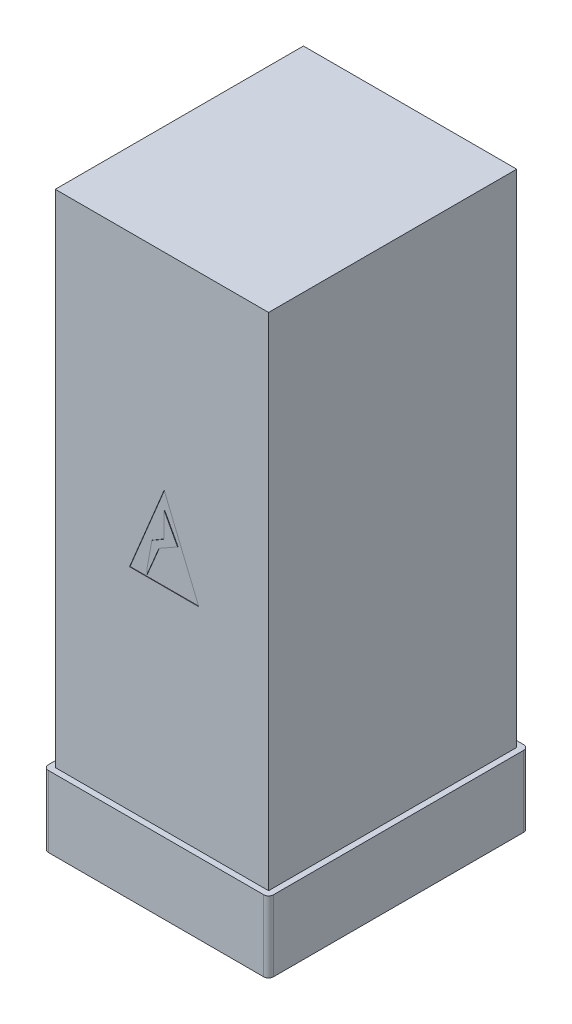
ISO-10303-21;
HEADER;
FILE_DESCRIPTION(('STEP AP214'),'2;1');
FILE_NAME('part.step','',(''),(''),'','','');
FILE_SCHEMA(('AUTOMOTIVE_DESIGN { 1 0 10303 214 1 1 1 1 }'));
ENDSEC;
DATA;
#1=APPLICATION_CONTEXT('core data for automotive mechanical design processes');
#2=APPLICATION_PROTOCOL_DEFINITION('international standard','automotive_design',2000,#1);
#3=PRODUCT_CONTEXT('',#1,'mechanical');
#4=PRODUCT('Part','Part','',(#3));
#5=PRODUCT_RELATED_PRODUCT_CATEGORY('part','',(#4));
#6=PRODUCT_DEFINITION_FORMATION('','',#4);
#7=PRODUCT_DEFINITION_CONTEXT('part definition',#1,'design');
#8=PRODUCT_DEFINITION('design','',#6,#7);
#9=PRODUCT_DEFINITION_SHAPE('','',#8);
#10=(LENGTH_UNIT() NAMED_UNIT(*) SI_UNIT(.MILLI.,.METRE.));
#11=(NAMED_UNIT(*) PLANE_ANGLE_UNIT() SI_UNIT($,.RADIAN.));
#12=(NAMED_UNIT(*) SI_UNIT($,.STERADIAN.) SOLID_ANGLE_UNIT());
#13=UNCERTAINTY_MEASURE_WITH_UNIT(LENGTH_MEASURE(1.E-05),#10,'distance_accuracy_value','');
#14=(GEOMETRIC_REPRESENTATION_CONTEXT(3) GLOBAL_UNCERTAINTY_ASSIGNED_CONTEXT((#13)) GLOBAL_UNIT_ASSIGNED_CONTEXT((#10,
#11,#12)) REPRESENTATION_CONTEXT('',''));
#15=CARTESIAN_POINT('',(0.,0.,0.));
#16=DIRECTION('',(0.,0.,1.));
#17=DIRECTION('',(1.,0.,0.));
#18=AXIS2_PLACEMENT_3D('',#15,#16,#17);
#19=CARTESIAN_POINT('',(-450.,2113.,523.5));
#20=DIRECTION('',(0.,0.,-1.));
#21=DIRECTION('',(-1.,0.,0.));
#22=AXIS2_PLACEMENT_3D('',#19,#20,#21);
#23=PLANE('',#22);
#24=DIRECTION('',(1.,0.,0.));
#25=VECTOR('',#24,1.);
#26=CARTESIAN_POINT('',(-136.509991438893,890.520139483411,523.5));
#27=LINE('',#26,#25);
#28=CARTESIAN_POINT('',(-136.509991438893,890.520139483411,523.5));
#29=VERTEX_POINT('',#28);
#30=CARTESIAN_POINT('',(155.469712472072,890.520139483411,523.5));
#31=VERTEX_POINT('',#30);
#32=EDGE_CURVE('E306',#29,#31,#27,.T.);
#33=ORIENTED_EDGE('',*,*,#32,.F.);
#34=DIRECTION('',(-0.382498039412264,-0.923956302995858,0.));
#35=VECTOR('',#34,1.);
#36=CARTESIAN_POINT('',(9.47986051658978,1243.17095070055,523.5));
#37=LINE('',#36,#35);
#38=CARTESIAN_POINT('',(9.47986051658978,1243.17095070055,523.5));
#39=VERTEX_POINT('',#38);
#40=EDGE_CURVE('E51',#39,#29,#37,.T.);
#41=ORIENTED_EDGE('',*,*,#40,.F.);
#42=DIRECTION('',(-0.382498039412264,0.923956302995858,0.));
#43=VECTOR('',#42,1.);
#44=CARTESIAN_POINT('',(155.469712472072,890.520139483411,523.5));
#45=LINE('',#44,#43);
#46=EDGE_CURVE('E298',#31,#39,#45,.T.);
#47=ORIENTED_EDGE('',*,*,#46,.F.);
#48=EDGE_LOOP('',(#33,#41,#47));
#49=FACE_BOUND('',#48,.T.);
#50=DIRECTION('',(1.,0.,0.));
#51=VECTOR('',#50,1.);
#52=CARTESIAN_POINT('',(-450.,0.,523.5));
#53=LINE('',#52,#51);
#54=CARTESIAN_POINT('',(-450.,0.,523.5));
#55=VERTEX_POINT('',#54);
#56=CARTESIAN_POINT('',(450.,0.,523.5));
#57=VERTEX_POINT('',#56);
#58=EDGE_CURVE('E349',#55,#57,#53,.T.);
#59=ORIENTED_EDGE('',*,*,#58,.T.);
#60=DIRECTION('',(0.,-1.,0.));
#61=VECTOR('',#60,1.);
#62=CARTESIAN_POINT('',(450.,2113.,523.5));
#63=LINE('',#62,#61);
#64=CARTESIAN_POINT('',(450.,2113.,523.5));
#65=VERTEX_POINT('',#64);
#66=EDGE_CURVE('E355',#65,#57,#63,.T.);
#67=ORIENTED_EDGE('',*,*,#66,.F.);
#68=DIRECTION('',(1.,0.,0.));
#69=VECTOR('',#68,1.);
#70=CARTESIAN_POINT('',(-450.,2113.,523.5));
#71=LINE('',#70,#69);
#72=CARTESIAN_POINT('',(-450.,2113.,523.5));
#73=VERTEX_POINT('',#72);
#74=EDGE_CURVE('E353',#73,#65,#71,.T.);
#75=ORIENTED_EDGE('',*,*,#74,.F.);
#76=DIRECTION('',(0.,-1.,0.));
#77=VECTOR('',#76,1.);
#78=CARTESIAN_POINT('',(-450.,2113.,523.5));
#79=LINE('',#78,#77);
#80=EDGE_CURVE('E368',#73,#55,#79,.T.);
#81=ORIENTED_EDGE('',*,*,#80,.T.);
#82=EDGE_LOOP('',(#59,#67,#75,#81));
#83=FACE_BOUND('',#82,.T.);
#84=ADVANCED_FACE('F35',(#49,#83),#23,.F.);
#85=CARTESIAN_POINT('',(450.,2113.,-523.5));
#86=DIRECTION('',(-1.,0.,0.));
#87=DIRECTION('',(0.,0.,1.));
#88=AXIS2_PLACEMENT_3D('',#85,#86,#87);
#89=PLANE('',#88);
#90=DIRECTION('',(0.,0.,-1.));
#91=VECTOR('',#90,1.);
#92=CARTESIAN_POINT('',(450.,0.,-523.5));
#93=LINE('',#92,#91);
#94=CARTESIAN_POINT('',(450.,0.,-523.5));
#95=VERTEX_POINT('',#94);
#96=EDGE_CURVE('E331',#57,#95,#93,.T.);
#97=ORIENTED_EDGE('',*,*,#96,.T.);
#98=DIRECTION('',(0.,-1.,0.));
#99=VECTOR('',#98,1.);
#100=CARTESIAN_POINT('',(450.,2113.,-523.5));
#101=LINE('',#100,#99);
#102=CARTESIAN_POINT('',(450.,2113.,-523.5));
#103=VERTEX_POINT('',#102);
#104=EDGE_CURVE('E11',#103,#95,#101,.T.);
#105=ORIENTED_EDGE('',*,*,#104,.F.);
#106=DIRECTION('',(0.,0.,-1.));
#107=VECTOR('',#106,1.);
#108=CARTESIAN_POINT('',(450.,2113.,-523.5));
#109=LINE('',#108,#107);
#110=EDGE_CURVE('E345',#65,#103,#109,.T.);
#111=ORIENTED_EDGE('',*,*,#110,.F.);
#112=ORIENTED_EDGE('',*,*,#66,.T.);
#113=EDGE_LOOP('',(#97,#105,#111,#112));
#114=FACE_BOUND('',#113,.T.);
#115=ADVANCED_FACE('F37',(#114),#89,.F.);
#116=CARTESIAN_POINT('',(-450.,2113.,-523.5));
#117=DIRECTION('',(0.,0.,1.));
#118=DIRECTION('',(1.,0.,0.));
#119=AXIS2_PLACEMENT_3D('',#116,#117,#118);
#120=PLANE('',#119);
#121=DIRECTION('',(-1.,0.,0.));
#122=VECTOR('',#121,1.);
#123=CARTESIAN_POINT('',(-450.,0.,-523.5));
#124=LINE('',#123,#122);
#125=CARTESIAN_POINT('',(-450.,0.,-523.5));
#126=VERTEX_POINT('',#125);
#127=EDGE_CURVE('E358',#95,#126,#124,.T.);
#128=ORIENTED_EDGE('',*,*,#127,.T.);
#129=DIRECTION('',(0.,-1.,0.));
#130=VECTOR('',#129,1.);
#131=CARTESIAN_POINT('',(-450.,2113.,-523.5));
#132=LINE('',#131,#130);
#133=CARTESIAN_POINT('',(-450.,2113.,-523.5));
#134=VERTEX_POINT('',#133);
#135=EDGE_CURVE('E44',#134,#126,#132,.T.);
#136=ORIENTED_EDGE('',*,*,#135,.F.);
#137=DIRECTION('',(-1.,0.,0.));
#138=VECTOR('',#137,1.);
#139=CARTESIAN_POINT('',(-450.,2113.,-523.5));
#140=LINE('',#139,#138);
#141=EDGE_CURVE('E348',#103,#134,#140,.T.);
#142=ORIENTED_EDGE('',*,*,#141,.F.);
#143=ORIENTED_EDGE('',*,*,#104,.T.);
#144=EDGE_LOOP('',(#128,#136,#142,#143));
#145=FACE_BOUND('',#144,.T.);
#146=ADVANCED_FACE('F377',(#145),#120,.F.);
#147=CARTESIAN_POINT('',(-450.,2113.,-523.5));
#148=DIRECTION('',(1.,0.,0.));
#149=DIRECTION('',(0.,0.,-1.));
#150=AXIS2_PLACEMENT_3D('',#147,#148,#149);
#151=PLANE('',#150);
#152=DIRECTION('',(0.,0.,1.));
#153=VECTOR('',#152,1.);
#154=CARTESIAN_POINT('',(-450.,0.,-523.5));
#155=LINE('',#154,#153);
#156=EDGE_CURVE('E361',#126,#55,#155,.T.);
#157=ORIENTED_EDGE('',*,*,#156,.T.);
#158=ORIENTED_EDGE('',*,*,#80,.F.);
#159=DIRECTION('',(0.,0.,1.));
#160=VECTOR('',#159,1.);
#161=CARTESIAN_POINT('',(-450.,2113.,-523.5));
#162=LINE('',#161,#160);
#163=EDGE_CURVE('E351',#134,#73,#162,.T.);
#164=ORIENTED_EDGE('',*,*,#163,.F.);
#165=ORIENTED_EDGE('',*,*,#135,.T.);
#166=EDGE_LOOP('',(#157,#158,#164,#165));
#167=FACE_BOUND('',#166,.T.);
#168=ADVANCED_FACE('F374',(#167),#151,.F.);
#169=CARTESIAN_POINT('',(0.,2113.,0.));
#170=DIRECTION('',(0.,1.,0.));
#171=DIRECTION('',(0.,0.,1.));
#172=AXIS2_PLACEMENT_3D('',#169,#170,#171);
#173=PLANE('',#172);
#174=ORIENTED_EDGE('',*,*,#110,.T.);
#175=ORIENTED_EDGE('',*,*,#141,.T.);
#176=ORIENTED_EDGE('',*,*,#163,.T.);
#177=ORIENTED_EDGE('',*,*,#74,.T.);
#178=EDGE_LOOP('',(#174,#175,#176,#177));
#179=FACE_BOUND('',#178,.T.);
#180=ADVANCED_FACE('F387',(#179),#173,.T.);
#181=CARTESIAN_POINT('',(9.47986051658978,1243.17095070055,521.5));
#182=DIRECTION('',(-0.923956302995858,0.382498039412264,0.));
#183=DIRECTION('',(-0.382498039412264,-0.923956302995858,0.));
#184=AXIS2_PLACEMENT_3D('',#181,#182,#183);
#185=PLANE('',#184);
#186=ORIENTED_EDGE('',*,*,#40,.T.);
#187=DIRECTION('',(0.,0.,1.));
#188=VECTOR('',#187,1.);
#189=CARTESIAN_POINT('',(-136.509991438893,890.520139483411,521.5));
#190=LINE('',#189,#188);
#191=CARTESIAN_POINT('',(-136.509991438893,890.520139483411,521.5));
#192=VERTEX_POINT('',#191);
#193=EDGE_CURVE('E304',#192,#29,#190,.T.);
#194=ORIENTED_EDGE('',*,*,#193,.F.);
#195=DIRECTION('',(-0.382498039412264,-0.923956302995858,0.));
#196=VECTOR('',#195,1.);
#197=CARTESIAN_POINT('',(9.47986051658978,1243.17095070055,521.5));
#198=LINE('',#197,#196);
#199=CARTESIAN_POINT('',(9.47986051658978,1243.17095070055,521.5));
#200=VERTEX_POINT('',#199);
#201=EDGE_CURVE('E294',#200,#192,#198,.T.);
#202=ORIENTED_EDGE('',*,*,#201,.F.);
#203=DIRECTION('',(0.,0.,1.));
#204=VECTOR('',#203,1.);
#205=CARTESIAN_POINT('',(9.47986051658978,1243.17095070055,521.5));
#206=LINE('',#205,#204);
#207=EDGE_CURVE('E311',#200,#39,#206,.T.);
#208=ORIENTED_EDGE('',*,*,#207,.T.);
#209=EDGE_LOOP('',(#186,#194,#202,#208));
#210=FACE_BOUND('',#209,.T.);
#211=ADVANCED_FACE('F389',(#210),#185,.F.);
#212=CARTESIAN_POINT('',(155.469712472072,890.520139483411,521.5));
#213=DIRECTION('',(0.923956302995858,0.382498039412264,0.));
#214=DIRECTION('',(-0.382498039412264,0.923956302995858,0.));
#215=AXIS2_PLACEMENT_3D('',#212,#213,#214);
#216=PLANE('',#215);
#217=ORIENTED_EDGE('',*,*,#46,.T.);
#218=ORIENTED_EDGE('',*,*,#207,.F.);
#219=DIRECTION('',(-0.382498039412264,0.923956302995858,0.));
#220=VECTOR('',#219,1.);
#221=CARTESIAN_POINT('',(155.469712472072,890.520139483411,521.5));
#222=LINE('',#221,#220);
#223=CARTESIAN_POINT('',(155.469712472072,890.520139483411,521.5));
#224=VERTEX_POINT('',#223);
#225=EDGE_CURVE('E301',#224,#200,#222,.T.);
#226=ORIENTED_EDGE('',*,*,#225,.F.);
#227=DIRECTION('',(0.,0.,1.));
#228=VECTOR('',#227,1.);
#229=CARTESIAN_POINT('',(155.469712472072,890.520139483411,521.5));
#230=LINE('',#229,#228);
#231=EDGE_CURVE('E314',#224,#31,#230,.T.);
#232=ORIENTED_EDGE('',*,*,#231,.T.);
#233=EDGE_LOOP('',(#217,#218,#226,#232));
#234=FACE_BOUND('',#233,.T.);
#235=ADVANCED_FACE('F395',(#234),#216,.F.);
#236=CARTESIAN_POINT('',(-136.509991438893,890.520139483411,521.5));
#237=DIRECTION('',(0.,-1.,0.));
#238=DIRECTION('',(0.,0.,-1.));
#239=AXIS2_PLACEMENT_3D('',#236,#237,#238);
#240=PLANE('',#239);
#241=ORIENTED_EDGE('',*,*,#32,.T.);
#242=ORIENTED_EDGE('',*,*,#231,.F.);
#243=DIRECTION('',(1.,0.,0.));
#244=VECTOR('',#243,1.);
#245=CARTESIAN_POINT('',(-136.509991438893,890.520139483411,521.5));
#246=LINE('',#245,#244);
#247=EDGE_CURVE('E297',#192,#224,#246,.T.);
#248=ORIENTED_EDGE('',*,*,#247,.F.);
#249=ORIENTED_EDGE('',*,*,#193,.T.);
#250=EDGE_LOOP('',(#241,#242,#248,#249));
#251=FACE_BOUND('',#250,.T.);
#252=ADVANCED_FACE('F463',(#251),#240,.F.);
#253=CARTESIAN_POINT('',(0.,0.,521.5));
#254=DIRECTION('',(0.,0.,1.));
#255=DIRECTION('',(1.,0.,0.));
#256=AXIS2_PLACEMENT_3D('',#253,#254,#255);
#257=PLANE('',#256);
#258=DIRECTION('',(-0.181458170868249,-0.983398663932969,0.));
#259=VECTOR('',#258,1.);
#260=CARTESIAN_POINT('',(-63.1768087324265,920.194596150194,521.5));
#261=LINE('',#260,#259);
#262=CARTESIAN_POINT('',(-42.1695458219167,1034.04184910241,521.5));
#263=VERTEX_POINT('',#262);
#264=CARTESIAN_POINT('',(-63.1768087324265,920.194596150194,521.5));
#265=VERTEX_POINT('',#264);
#266=EDGE_CURVE('E263',#263,#265,#261,.T.);
#267=ORIENTED_EDGE('',*,*,#266,.F.);
#268=DIRECTION('',(-0.863784349846672,-0.503861684353913,0.));
#269=VECTOR('',#268,1.);
#270=CARTESIAN_POINT('',(-42.1695458219167,1034.04184910241,521.5));
#271=LINE('',#270,#269);
#272=CARTESIAN_POINT('',(9.47986051658978,1064.16992085807,521.5));
#273=VERTEX_POINT('',#272);
#274=EDGE_CURVE('E260',#273,#263,#271,.T.);
#275=ORIENTED_EDGE('',*,*,#274,.F.);
#276=DIRECTION('',(0.,-1.,0.));
#277=VECTOR('',#276,1.);
#278=CARTESIAN_POINT('',(9.47986051658978,1064.16992085807,521.5));
#279=LINE('',#278,#277);
#280=CARTESIAN_POINT('',(9.47986051658978,1169.41196385255,521.5));
#281=VERTEX_POINT('',#280);
#282=EDGE_CURVE('E257',#281,#273,#279,.T.);
#283=ORIENTED_EDGE('',*,*,#282,.F.);
#284=DIRECTION('',(-0.472916146029514,0.881107438865767,0.));
#285=VECTOR('',#284,1.);
#286=CARTESIAN_POINT('',(9.47986051658978,1169.41196385255,521.5));
#287=LINE('',#286,#285);
#288=CARTESIAN_POINT('',(65.9663446589673,1064.16992085807,521.5));
#289=VERTEX_POINT('',#288);
#290=EDGE_CURVE('E254',#289,#281,#287,.T.);
#291=ORIENTED_EDGE('',*,*,#290,.F.);
#292=DIRECTION('',(0.869719659928419,0.493546059789758,0.));
#293=VECTOR('',#292,1.);
#294=CARTESIAN_POINT('',(65.9663446589673,1064.16992085807,521.5));
#295=LINE('',#294,#293);
#296=CARTESIAN_POINT('',(-12.5323017641928,1019.62373037163,521.5));
#297=VERTEX_POINT('',#296);
#298=EDGE_CURVE('E251',#297,#289,#295,.T.);
#299=ORIENTED_EDGE('',*,*,#298,.F.);
#300=DIRECTION('',(0.386882203116871,0.922129145462519,0.));
#301=VECTOR('',#300,1.);
#302=CARTESIAN_POINT('',(-12.5323017641928,1019.62373037163,521.5));
#303=LINE('',#302,#301);
#304=CARTESIAN_POINT('',(-63.1768087324265,898.91314829587,521.5));
#305=VERTEX_POINT('',#304);
#306=EDGE_CURVE('E247',#305,#297,#303,.T.);
#307=ORIENTED_EDGE('',*,*,#306,.F.);
#308=DIRECTION('',(0.,-1.,0.));
#309=VECTOR('',#308,1.);
#310=CARTESIAN_POINT('',(-63.1768087324265,898.91314829587,521.5));
#311=LINE('',#310,#309);
#312=EDGE_CURVE('E244',#265,#305,#311,.T.);
#313=ORIENTED_EDGE('',*,*,#312,.F.);
#314=EDGE_LOOP('',(#267,#275,#283,#291,#299,#307,#313));
#315=FACE_BOUND('',#314,.T.);
#316=ORIENTED_EDGE('',*,*,#201,.T.);
#317=ORIENTED_EDGE('',*,*,#247,.T.);
#318=ORIENTED_EDGE('',*,*,#225,.T.);
#319=EDGE_LOOP('',(#316,#317,#318));
#320=FACE_BOUND('',#319,.T.);
#321=ADVANCED_FACE('F430',(#315,#320),#257,.T.);
#322=CARTESIAN_POINT('',(-63.1768087324265,898.91314829587,521.5));
#323=DIRECTION('',(-1.,0.,0.));
#324=DIRECTION('',(0.,0.,1.));
#325=AXIS2_PLACEMENT_3D('',#322,#323,#324);
#326=PLANE('',#325);
#327=DIRECTION('',(0.,-1.,0.));
#328=VECTOR('',#327,1.);
#329=CARTESIAN_POINT('',(-63.1768087324265,898.91314829587,523.5));
#330=LINE('',#329,#328);
#331=CARTESIAN_POINT('',(-63.1768087324265,920.194596150194,523.5));
#332=VERTEX_POINT('',#331);
#333=CARTESIAN_POINT('',(-63.1768087324264,898.91314829587,523.5));
#334=VERTEX_POINT('',#333);
#335=EDGE_CURVE('E235',#332,#334,#330,.T.);
#336=ORIENTED_EDGE('',*,*,#335,.F.);
#337=DIRECTION('',(0.,0.,1.));
#338=VECTOR('',#337,1.);
#339=CARTESIAN_POINT('',(-63.1768087324265,920.194596150194,521.5));
#340=LINE('',#339,#338);
#341=EDGE_CURVE('E281',#265,#332,#340,.T.);
#342=ORIENTED_EDGE('',*,*,#341,.F.);
#343=ORIENTED_EDGE('',*,*,#312,.T.);
#344=DIRECTION('',(0.,0.,1.));
#345=VECTOR('',#344,1.);
#346=CARTESIAN_POINT('',(-63.1768087324265,898.91314829587,521.5));
#347=LINE('',#346,#345);
#348=EDGE_CURVE('E265',#305,#334,#347,.T.);
#349=ORIENTED_EDGE('',*,*,#348,.T.);
#350=EDGE_LOOP('',(#336,#342,#343,#349));
#351=FACE_BOUND('',#350,.T.);
#352=ADVANCED_FACE('F423',(#351),#326,.T.);
#353=CARTESIAN_POINT('',(-63.1768087324265,920.194596150194,521.5));
#354=DIRECTION('',(-0.983398663932969,0.181458170868249,0.));
#355=DIRECTION('',(-0.181458170868249,-0.983398663932969,0.));
#356=AXIS2_PLACEMENT_3D('',#353,#354,#355);
#357=PLANE('',#356);
#358=DIRECTION('',(-0.181458170868249,-0.983398663932969,0.));
#359=VECTOR('',#358,1.);
#360=CARTESIAN_POINT('',(-63.1768087324265,920.194596150194,523.5));
#361=LINE('',#360,#359);
#362=CARTESIAN_POINT('',(-42.1695458219167,1034.04184910241,523.5));
#363=VERTEX_POINT('',#362);
#364=EDGE_CURVE('E248',#363,#332,#361,.T.);
#365=ORIENTED_EDGE('',*,*,#364,.F.);
#366=DIRECTION('',(0.,0.,1.));
#367=VECTOR('',#366,1.);
#368=CARTESIAN_POINT('',(-42.1695458219167,1034.04184910241,521.5));
#369=LINE('',#368,#367);
#370=EDGE_CURVE('E283',#263,#363,#369,.T.);
#371=ORIENTED_EDGE('',*,*,#370,.F.);
#372=ORIENTED_EDGE('',*,*,#266,.T.);
#373=ORIENTED_EDGE('',*,*,#341,.T.);
#374=EDGE_LOOP('',(#365,#371,#372,#373));
#375=FACE_BOUND('',#374,.T.);
#376=ADVANCED_FACE('F443',(#375),#357,.T.);
#377=CARTESIAN_POINT('',(-42.1695458219167,1034.04184910241,521.5));
#378=DIRECTION('',(-0.503861684353913,0.863784349846672,0.));
#379=DIRECTION('',(-0.863784349846672,-0.503861684353913,0.));
#380=AXIS2_PLACEMENT_3D('',#377,#378,#379);
#381=PLANE('',#380);
#382=DIRECTION('',(-0.863784349846672,-0.503861684353913,0.));
#383=VECTOR('',#382,1.);
#384=CARTESIAN_POINT('',(-42.1695458219167,1034.04184910241,523.5));
#385=LINE('',#384,#383);
#386=CARTESIAN_POINT('',(9.47986051658978,1064.16992085807,523.5));
#387=VERTEX_POINT('',#386);
#388=EDGE_CURVE('E276',#387,#363,#385,.T.);
#389=ORIENTED_EDGE('',*,*,#388,.F.);
#390=DIRECTION('',(0.,0.,1.));
#391=VECTOR('',#390,1.);
#392=CARTESIAN_POINT('',(9.47986051658978,1064.16992085807,521.5));
#393=LINE('',#392,#391);
#394=EDGE_CURVE('E285',#273,#387,#393,.T.);
#395=ORIENTED_EDGE('',*,*,#394,.F.);
#396=ORIENTED_EDGE('',*,*,#274,.T.);
#397=ORIENTED_EDGE('',*,*,#370,.T.);
#398=EDGE_LOOP('',(#389,#395,#396,#397));
#399=FACE_BOUND('',#398,.T.);
#400=ADVANCED_FACE('F441',(#399),#381,.T.);
#401=CARTESIAN_POINT('',(9.47986051658978,1064.16992085807,521.5));
#402=DIRECTION('',(-1.,0.,0.));
#403=DIRECTION('',(0.,0.,1.));
#404=AXIS2_PLACEMENT_3D('',#401,#402,#403);
#405=PLANE('',#404);
#406=DIRECTION('',(0.,-1.,0.));
#407=VECTOR('',#406,1.);
#408=CARTESIAN_POINT('',(9.47986051658978,1064.16992085807,523.5));
#409=LINE('',#408,#407);
#410=CARTESIAN_POINT('',(9.47986051658978,1169.41196385255,523.5));
#411=VERTEX_POINT('',#410);
#412=EDGE_CURVE('E273',#411,#387,#409,.T.);
#413=ORIENTED_EDGE('',*,*,#412,.F.);
#414=DIRECTION('',(0.,0.,1.));
#415=VECTOR('',#414,1.);
#416=CARTESIAN_POINT('',(9.47986051658978,1169.41196385255,521.5));
#417=LINE('',#416,#415);
#418=EDGE_CURVE('E287',#281,#411,#417,.T.);
#419=ORIENTED_EDGE('',*,*,#418,.F.);
#420=ORIENTED_EDGE('',*,*,#282,.T.);
#421=ORIENTED_EDGE('',*,*,#394,.T.);
#422=EDGE_LOOP('',(#413,#419,#420,#421));
#423=FACE_BOUND('',#422,.T.);
#424=ADVANCED_FACE('F439',(#423),#405,.T.);
#425=CARTESIAN_POINT('',(9.47986051658978,1169.41196385255,521.5));
#426=DIRECTION('',(0.881107438865767,0.472916146029514,0.));
#427=DIRECTION('',(-0.472916146029514,0.881107438865767,0.));
#428=AXIS2_PLACEMENT_3D('',#425,#426,#427);
#429=PLANE('',#428);
#430=DIRECTION('',(-0.472916146029514,0.881107438865767,0.));
#431=VECTOR('',#430,1.);
#432=CARTESIAN_POINT('',(9.47986051658978,1169.41196385255,523.5));
#433=LINE('',#432,#431);
#434=CARTESIAN_POINT('',(65.9663446589673,1064.16992085807,523.5));
#435=VERTEX_POINT('',#434);
#436=EDGE_CURVE('E270',#435,#411,#433,.T.);
#437=ORIENTED_EDGE('',*,*,#436,.F.);
#438=DIRECTION('',(0.,0.,1.));
#439=VECTOR('',#438,1.);
#440=CARTESIAN_POINT('',(65.9663446589673,1064.16992085807,521.5));
#441=LINE('',#440,#439);
#442=EDGE_CURVE('E289',#289,#435,#441,.T.);
#443=ORIENTED_EDGE('',*,*,#442,.F.);
#444=ORIENTED_EDGE('',*,*,#290,.T.);
#445=ORIENTED_EDGE('',*,*,#418,.T.);
#446=EDGE_LOOP('',(#437,#443,#444,#445));
#447=FACE_BOUND('',#446,.T.);
#448=ADVANCED_FACE('F435',(#447),#429,.T.);
#449=CARTESIAN_POINT('',(65.9663446589673,1064.16992085807,521.5));
#450=DIRECTION('',(0.493546059789758,-0.869719659928419,0.));
#451=DIRECTION('',(0.869719659928419,0.493546059789758,0.));
#452=AXIS2_PLACEMENT_3D('',#449,#450,#451);
#453=PLANE('',#452);
#454=DIRECTION('',(0.869719659928419,0.493546059789758,0.));
#455=VECTOR('',#454,1.);
#456=CARTESIAN_POINT('',(65.9663446589673,1064.16992085807,523.5));
#457=LINE('',#456,#455);
#458=CARTESIAN_POINT('',(-12.532301764193,1019.62373037163,523.5));
#459=VERTEX_POINT('',#458);
#460=EDGE_CURVE('E59',#459,#435,#457,.T.);
#461=ORIENTED_EDGE('',*,*,#460,.F.);
#462=DIRECTION('',(0.,0.,1.));
#463=VECTOR('',#462,1.);
#464=CARTESIAN_POINT('',(-12.5323017641928,1019.62373037163,521.5));
#465=LINE('',#464,#463);
#466=EDGE_CURVE('E291',#297,#459,#465,.T.);
#467=ORIENTED_EDGE('',*,*,#466,.F.);
#468=ORIENTED_EDGE('',*,*,#298,.T.);
#469=ORIENTED_EDGE('',*,*,#442,.T.);
#470=EDGE_LOOP('',(#461,#467,#468,#469));
#471=FACE_BOUND('',#470,.T.);
#472=ADVANCED_FACE('F416',(#471),#453,.T.);
#473=CARTESIAN_POINT('',(-12.5323017641928,1019.62373037163,521.5));
#474=DIRECTION('',(0.922129145462519,-0.386882203116871,0.));
#475=DIRECTION('',(0.386882203116871,0.92212914546252,0.));
#476=AXIS2_PLACEMENT_3D('',#473,#474,#475);
#477=PLANE('',#476);
#478=DIRECTION('',(0.386882203116871,0.922129145462519,0.));
#479=VECTOR('',#478,1.);
#480=CARTESIAN_POINT('',(-12.5323017641928,1019.62373037163,523.5));
#481=LINE('',#480,#479);
#482=EDGE_CURVE('E238',#334,#459,#481,.T.);
#483=ORIENTED_EDGE('',*,*,#482,.F.);
#484=ORIENTED_EDGE('',*,*,#348,.F.);
#485=ORIENTED_EDGE('',*,*,#306,.T.);
#486=ORIENTED_EDGE('',*,*,#466,.T.);
#487=EDGE_LOOP('',(#483,#484,#485,#486));
#488=FACE_BOUND('',#487,.T.);
#489=ADVANCED_FACE('F408',(#488),#477,.T.);
#490=ORIENTED_EDGE('',*,*,#335,.T.);
#491=ORIENTED_EDGE('',*,*,#482,.T.);
#492=ORIENTED_EDGE('',*,*,#460,.T.);
#493=ORIENTED_EDGE('',*,*,#436,.T.);
#494=ORIENTED_EDGE('',*,*,#412,.T.);
#495=ORIENTED_EDGE('',*,*,#388,.T.);
#496=ORIENTED_EDGE('',*,*,#364,.T.);
#497=EDGE_LOOP('',(#490,#491,#492,#493,#494,#495,#496));
#498=FACE_BOUND('',#497,.T.);
#499=ADVANCED_FACE('F402',(#498),#23,.F.);
#500=CARTESIAN_POINT('',(454.356451520061,0.,527.856451520061));
#501=DIRECTION('',(0.,1.,0.));
#502=DIRECTION('',(0.,0.,1.));
#503=AXIS2_PLACEMENT_3D('',#500,#501,#502);
#504=PLANE('',#503);
#505=CARTESIAN_POINT('',(454.356451520061,0.,527.856451520061));
#506=DIRECTION('',(0.,-1.,0.));
#507=DIRECTION('',(0.,0.,1.));
#508=AXIS2_PLACEMENT_3D('',#505,#506,#507);
#509=CIRCLE('',#508,20.643548479939);
#510=CARTESIAN_POINT('',(475.,0.,527.856451520061));
#511=VERTEX_POINT('',#510);
#512=CARTESIAN_POINT('',(454.356451520061,0.,548.5));
#513=VERTEX_POINT('',#512);
#514=EDGE_CURVE('E234',#511,#513,#509,.T.);
#515=ORIENTED_EDGE('',*,*,#514,.F.);
#516=DIRECTION('',(0.,0.,1.));
#517=VECTOR('',#516,1.);
#518=CARTESIAN_POINT('',(475.,0.,527.856451520061));
#519=LINE('',#518,#517);
#520=CARTESIAN_POINT('',(475.,0.,-527.856451520061));
#521=VERTEX_POINT('',#520);
#522=EDGE_CURVE('E230',#521,#511,#519,.T.);
#523=ORIENTED_EDGE('',*,*,#522,.F.);
#524=CARTESIAN_POINT('',(454.356451520061,0.,-527.856451520061));
#525=DIRECTION('',(0.,-1.,0.));
#526=DIRECTION('',(0.,0.,-1.));
#527=AXIS2_PLACEMENT_3D('',#524,#525,#526);
#528=CIRCLE('',#527,20.643548479939);
#529=CARTESIAN_POINT('',(454.356451520061,0.,-548.5));
#530=VERTEX_POINT('',#529);
#531=EDGE_CURVE('E761',#530,#521,#528,.T.);
#532=ORIENTED_EDGE('',*,*,#531,.F.);
#533=DIRECTION('',(1.,0.,0.));
#534=VECTOR('',#533,1.);
#535=CARTESIAN_POINT('',(-454.356451520061,0.,-548.5));
#536=LINE('',#535,#534);
#537=CARTESIAN_POINT('',(-454.356451520061,0.,-548.5));
#538=VERTEX_POINT('',#537);
#539=EDGE_CURVE('E777',#538,#530,#536,.T.);
#540=ORIENTED_EDGE('',*,*,#539,.F.);
#541=CARTESIAN_POINT('',(-454.356451520061,0.,-527.856451520061));
#542=DIRECTION('',(0.,-1.,0.));
#543=DIRECTION('',(0.,0.,-1.));
#544=AXIS2_PLACEMENT_3D('',#541,#542,#543);
#545=CIRCLE('',#544,20.643548479939);
#546=CARTESIAN_POINT('',(-475.,0.,-527.856451520061));
#547=VERTEX_POINT('',#546);
#548=EDGE_CURVE('E775',#547,#538,#545,.T.);
#549=ORIENTED_EDGE('',*,*,#548,.F.);
#550=DIRECTION('',(0.,0.,-1.));
#551=VECTOR('',#550,1.);
#552=CARTESIAN_POINT('',(-475.,0.,527.856451520061));
#553=LINE('',#552,#551);
#554=CARTESIAN_POINT('',(-475.,0.,527.856451520061));
#555=VERTEX_POINT('',#554);
#556=EDGE_CURVE('E773',#555,#547,#553,.T.);
#557=ORIENTED_EDGE('',*,*,#556,.F.);
#558=CARTESIAN_POINT('',(-454.356451520061,0.,527.856451520061));
#559=DIRECTION('',(0.,-1.,0.));
#560=DIRECTION('',(0.,0.,-1.));
#561=AXIS2_PLACEMENT_3D('',#558,#559,#560);
#562=CIRCLE('',#561,20.643548479939);
#563=CARTESIAN_POINT('',(-454.356451520061,0.,548.5));
#564=VERTEX_POINT('',#563);
#565=EDGE_CURVE('E767',#564,#555,#562,.T.);
#566=ORIENTED_EDGE('',*,*,#565,.F.);
#567=DIRECTION('',(-1.,0.,0.));
#568=VECTOR('',#567,1.);
#569=CARTESIAN_POINT('',(-454.356451520061,0.,548.5));
#570=LINE('',#569,#568);
#571=EDGE_CURVE('E765',#513,#564,#570,.T.);
#572=ORIENTED_EDGE('',*,*,#571,.F.);
#573=EDGE_LOOP('',(#515,#523,#532,#540,#549,#557,#566,#572));
#574=FACE_BOUND('',#573,.T.);
#575=ORIENTED_EDGE('',*,*,#58,.F.);
#576=ORIENTED_EDGE('',*,*,#156,.F.);
#577=ORIENTED_EDGE('',*,*,#127,.F.);
#578=ORIENTED_EDGE('',*,*,#96,.F.);
#579=EDGE_LOOP('',(#575,#576,#577,#578));
#580=FACE_BOUND('',#579,.T.);
#581=ADVANCED_FACE('F380',(#574,#580),#504,.T.);
#582=CARTESIAN_POINT('',(454.356451520061,-300.,527.856451520061));
#583=DIRECTION('',(0.,1.,0.));
#584=DIRECTION('',(0.,0.,1.));
#585=AXIS2_PLACEMENT_3D('',#582,#583,#584);
#586=CYLINDRICAL_SURFACE('',#585,20.643548479939);
#587=ORIENTED_EDGE('',*,*,#514,.T.);
#588=DIRECTION('',(0.,1.,0.));
#589=VECTOR('',#588,1.);
#590=CARTESIAN_POINT('',(454.356451520061,-300.,548.5));
#591=LINE('',#590,#589);
#592=CARTESIAN_POINT('',(454.356451520061,-300.,548.5));
#593=VERTEX_POINT('',#592);
#594=EDGE_CURVE('E214',#593,#513,#591,.T.);
#595=ORIENTED_EDGE('',*,*,#594,.F.);
#596=CARTESIAN_POINT('',(454.356451520061,-300.,527.856451520061));
#597=DIRECTION('',(0.,-1.,0.));
#598=DIRECTION('',(0.,0.,1.));
#599=AXIS2_PLACEMENT_3D('',#596,#597,#598);
#600=CIRCLE('',#599,20.643548479939);
#601=CARTESIAN_POINT('',(475.,-300.,527.856451520061));
#602=VERTEX_POINT('',#601);
#603=EDGE_CURVE('E221',#602,#593,#600,.T.);
#604=ORIENTED_EDGE('',*,*,#603,.F.);
#605=DIRECTION('',(0.,1.,0.));
#606=VECTOR('',#605,1.);
#607=CARTESIAN_POINT('',(475.,-300.,527.856451520061));
#608=LINE('',#607,#606);
#609=EDGE_CURVE('E757',#602,#511,#608,.T.);
#610=ORIENTED_EDGE('',*,*,#609,.T.);
#611=EDGE_LOOP('',(#587,#595,#604,#610));
#612=FACE_BOUND('',#611,.T.);
#613=ADVANCED_FACE('F232',(#612),#586,.T.);
#614=CARTESIAN_POINT('',(-454.356451520061,-300.,548.5));
#615=DIRECTION('',(0.,0.,-1.));
#616=DIRECTION('',(-1.,0.,0.));
#617=AXIS2_PLACEMENT_3D('',#614,#615,#616);
#618=PLANE('',#617);
#619=ORIENTED_EDGE('',*,*,#571,.T.);
#620=DIRECTION('',(0.,1.,0.));
#621=VECTOR('',#620,1.);
#622=CARTESIAN_POINT('',(-454.356451520061,-300.,548.5));
#623=LINE('',#622,#621);
#624=CARTESIAN_POINT('',(-454.356451520061,-300.,548.5));
#625=VERTEX_POINT('',#624);
#626=EDGE_CURVE('E217',#625,#564,#623,.T.);
#627=ORIENTED_EDGE('',*,*,#626,.F.);
#628=DIRECTION('',(-1.,0.,0.));
#629=VECTOR('',#628,1.);
#630=CARTESIAN_POINT('',(-454.356451520061,-300.,548.5));
#631=LINE('',#630,#629);
#632=EDGE_CURVE('E210',#593,#625,#631,.T.);
#633=ORIENTED_EDGE('',*,*,#632,.F.);
#634=ORIENTED_EDGE('',*,*,#594,.T.);
#635=EDGE_LOOP('',(#619,#627,#633,#634));
#636=FACE_BOUND('',#635,.T.);
#637=ADVANCED_FACE('F212',(#636),#618,.F.);
#638=CARTESIAN_POINT('',(-454.356451520061,-300.,527.856451520061));
#639=DIRECTION('',(0.,1.,0.));
#640=DIRECTION('',(0.,0.,1.));
#641=AXIS2_PLACEMENT_3D('',#638,#639,#640);
#642=CYLINDRICAL_SURFACE('',#641,20.643548479939);
#643=ORIENTED_EDGE('',*,*,#565,.T.);
#644=DIRECTION('',(0.,1.,0.));
#645=VECTOR('',#644,1.);
#646=CARTESIAN_POINT('',(-475.,-300.,527.856451520061));
#647=LINE('',#646,#645);
#648=CARTESIAN_POINT('',(-475.,-300.,527.856451520061));
#649=VERTEX_POINT('',#648);
#650=EDGE_CURVE('E240',#649,#555,#647,.T.);
#651=ORIENTED_EDGE('',*,*,#650,.F.);
#652=CARTESIAN_POINT('',(-454.356451520061,-300.,527.856451520061));
#653=DIRECTION('',(0.,-1.,0.));
#654=DIRECTION('',(0.,0.,-1.));
#655=AXIS2_PLACEMENT_3D('',#652,#653,#654);
#656=CIRCLE('',#655,20.643548479939);
#657=EDGE_CURVE('E220',#625,#649,#656,.T.);
#658=ORIENTED_EDGE('',*,*,#657,.F.);
#659=ORIENTED_EDGE('',*,*,#626,.T.);
#660=EDGE_LOOP('',(#643,#651,#658,#659));
#661=FACE_BOUND('',#660,.T.);
#662=ADVANCED_FACE('F645',(#661),#642,.T.);
#663=CARTESIAN_POINT('',(-475.,-300.,527.856451520061));
#664=DIRECTION('',(1.,0.,0.));
#665=DIRECTION('',(0.,0.,-1.));
#666=AXIS2_PLACEMENT_3D('',#663,#664,#665);
#667=PLANE('',#666);
#668=ORIENTED_EDGE('',*,*,#556,.T.);
#669=DIRECTION('',(0.,1.,0.));
#670=VECTOR('',#669,1.);
#671=CARTESIAN_POINT('',(-475.,-300.,-527.856451520061));
#672=LINE('',#671,#670);
#673=CARTESIAN_POINT('',(-475.,-300.,-527.856451520061));
#674=VERTEX_POINT('',#673);
#675=EDGE_CURVE('E787',#674,#547,#672,.T.);
#676=ORIENTED_EDGE('',*,*,#675,.F.);
#677=DIRECTION('',(0.,0.,-1.));
#678=VECTOR('',#677,1.);
#679=CARTESIAN_POINT('',(-475.,-300.,527.856451520061));
#680=LINE('',#679,#678);
#681=EDGE_CURVE('E794',#649,#674,#680,.T.);
#682=ORIENTED_EDGE('',*,*,#681,.F.);
#683=ORIENTED_EDGE('',*,*,#650,.T.);
#684=EDGE_LOOP('',(#668,#676,#682,#683));
#685=FACE_BOUND('',#684,.T.);
#686=ADVANCED_FACE('F654',(#685),#667,.F.);
#687=CARTESIAN_POINT('',(-454.356451520061,-300.,-527.856451520061));
#688=DIRECTION('',(0.,1.,0.));
#689=DIRECTION('',(0.,0.,1.));
#690=AXIS2_PLACEMENT_3D('',#687,#688,#689);
#691=CYLINDRICAL_SURFACE('',#690,20.643548479939);
#692=ORIENTED_EDGE('',*,*,#548,.T.);
#693=DIRECTION('',(0.,1.,0.));
#694=VECTOR('',#693,1.);
#695=CARTESIAN_POINT('',(-454.356451520061,-300.,-548.5));
#696=LINE('',#695,#694);
#697=CARTESIAN_POINT('',(-454.356451520061,-300.,-548.5));
#698=VERTEX_POINT('',#697);
#699=EDGE_CURVE('E784',#698,#538,#696,.T.);
#700=ORIENTED_EDGE('',*,*,#699,.F.);
#701=CARTESIAN_POINT('',(-454.356451520061,-300.,-527.856451520061));
#702=DIRECTION('',(0.,-1.,0.));
#703=DIRECTION('',(0.,0.,-1.));
#704=AXIS2_PLACEMENT_3D('',#701,#702,#703);
#705=CIRCLE('',#704,20.643548479939);
#706=EDGE_CURVE('E804',#674,#698,#705,.T.);
#707=ORIENTED_EDGE('',*,*,#706,.F.);
#708=ORIENTED_EDGE('',*,*,#675,.T.);
#709=EDGE_LOOP('',(#692,#700,#707,#708));
#710=FACE_BOUND('',#709,.T.);
#711=ADVANCED_FACE('F664',(#710),#691,.T.);
#712=CARTESIAN_POINT('',(-454.356451520061,-300.,-548.5));
#713=DIRECTION('',(0.,0.,1.));
#714=DIRECTION('',(1.,0.,0.));
#715=AXIS2_PLACEMENT_3D('',#712,#713,#714);
#716=PLANE('',#715);
#717=ORIENTED_EDGE('',*,*,#539,.T.);
#718=DIRECTION('',(0.,1.,0.));
#719=VECTOR('',#718,1.);
#720=CARTESIAN_POINT('',(454.356451520061,-300.,-548.5));
#721=LINE('',#720,#719);
#722=CARTESIAN_POINT('',(454.356451520061,-300.,-548.5));
#723=VERTEX_POINT('',#722);
#724=EDGE_CURVE('E781',#723,#530,#721,.T.);
#725=ORIENTED_EDGE('',*,*,#724,.F.);
#726=DIRECTION('',(1.,0.,0.));
#727=VECTOR('',#726,1.);
#728=CARTESIAN_POINT('',(-454.356451520061,-300.,-548.5));
#729=LINE('',#728,#727);
#730=EDGE_CURVE('E801',#698,#723,#729,.T.);
#731=ORIENTED_EDGE('',*,*,#730,.F.);
#732=ORIENTED_EDGE('',*,*,#699,.T.);
#733=EDGE_LOOP('',(#717,#725,#731,#732));
#734=FACE_BOUND('',#733,.T.);
#735=ADVANCED_FACE('F675',(#734),#716,.F.);
#736=CARTESIAN_POINT('',(454.356451520061,-300.,-527.856451520061));
#737=DIRECTION('',(0.,1.,0.));
#738=DIRECTION('',(0.,0.,1.));
#739=AXIS2_PLACEMENT_3D('',#736,#737,#738);
#740=CYLINDRICAL_SURFACE('',#739,20.643548479939);
#741=ORIENTED_EDGE('',*,*,#531,.T.);
#742=DIRECTION('',(0.,1.,0.));
#743=VECTOR('',#742,1.);
#744=CARTESIAN_POINT('',(475.,-300.,-527.856451520061));
#745=LINE('',#744,#743);
#746=CARTESIAN_POINT('',(475.,-300.,-527.856451520061));
#747=VERTEX_POINT('',#746);
#748=EDGE_CURVE('E759',#747,#521,#745,.T.);
#749=ORIENTED_EDGE('',*,*,#748,.F.);
#750=CARTESIAN_POINT('',(454.356451520061,-300.,-527.856451520061));
#751=DIRECTION('',(0.,-1.,0.));
#752=DIRECTION('',(0.,0.,-1.));
#753=AXIS2_PLACEMENT_3D('',#750,#751,#752);
#754=CIRCLE('',#753,20.643548479939);
#755=EDGE_CURVE('E803',#723,#747,#754,.T.);
#756=ORIENTED_EDGE('',*,*,#755,.F.);
#757=ORIENTED_EDGE('',*,*,#724,.T.);
#758=EDGE_LOOP('',(#741,#749,#756,#757));
#759=FACE_BOUND('',#758,.T.);
#760=ADVANCED_FACE('F685',(#759),#740,.T.);
#761=CARTESIAN_POINT('',(475.,-300.,527.856451520061));
#762=DIRECTION('',(-1.,0.,0.));
#763=DIRECTION('',(0.,0.,1.));
#764=AXIS2_PLACEMENT_3D('',#761,#762,#763);
#765=PLANE('',#764);
#766=ORIENTED_EDGE('',*,*,#522,.T.);
#767=ORIENTED_EDGE('',*,*,#609,.F.);
#768=DIRECTION('',(0.,0.,1.));
#769=VECTOR('',#768,1.);
#770=CARTESIAN_POINT('',(475.,-300.,527.856451520061));
#771=LINE('',#770,#769);
#772=EDGE_CURVE('E226',#747,#602,#771,.T.);
#773=ORIENTED_EDGE('',*,*,#772,.F.);
#774=ORIENTED_EDGE('',*,*,#748,.T.);
#775=EDGE_LOOP('',(#766,#767,#773,#774));
#776=FACE_BOUND('',#775,.T.);
#777=ADVANCED_FACE('F695',(#776),#765,.F.);
#778=CARTESIAN_POINT('',(454.356451520061,-300.,527.856451520061));
#779=DIRECTION('',(0.,1.,0.));
#780=DIRECTION('',(0.,0.,1.));
#781=AXIS2_PLACEMENT_3D('',#778,#779,#780);
#782=PLANE('',#781);
#783=ORIENTED_EDGE('',*,*,#603,.T.);
#784=ORIENTED_EDGE('',*,*,#632,.T.);
#785=ORIENTED_EDGE('',*,*,#657,.T.);
#786=ORIENTED_EDGE('',*,*,#681,.T.);
#787=ORIENTED_EDGE('',*,*,#706,.T.);
#788=ORIENTED_EDGE('',*,*,#730,.T.);
#789=ORIENTED_EDGE('',*,*,#755,.T.);
#790=ORIENTED_EDGE('',*,*,#772,.T.);
#791=EDGE_LOOP('',(#783,#784,#785,#786,#787,#788,#789,#790));
#792=FACE_BOUND('',#791,.T.);
#793=ADVANCED_FACE('F224',(#792),#782,.F.);
#794=CLOSED_SHELL('',(#84,#115,#146,#168,#180,#211,#235,#252,#321,#352,#376,#400,#424,#448,#472,
#489,#499,#581,#613,#637,#662,#686,#711,#735,#760,#777,#793));
#795=CARTESIAN_POINT('',(0.,0.,518.5));
#796=DIRECTION('',(0.,0.,-1.));
#797=DIRECTION('',(-1.,0.,0.));
#798=AXIS2_PLACEMENT_3D('',#795,#796,#797);
#799=PLANE('',#798);
#800=DIRECTION('',(0.,-1.,0.));
#801=VECTOR('',#800,1.);
#802=CARTESIAN_POINT('',(-440.,10.,518.5));
#803=LINE('',#802,#801);
#804=CARTESIAN_POINT('',(-440.,2103.,518.5));
#805=VERTEX_POINT('',#804);
#806=CARTESIAN_POINT('',(-440.,10.,518.5));
#807=VERTEX_POINT('',#806);
#808=EDGE_CURVE('E313',#805,#807,#803,.T.);
#809=ORIENTED_EDGE('',*,*,#808,.F.);
#810=DIRECTION('',(-1.,0.,0.));
#811=VECTOR('',#810,1.);
#812=CARTESIAN_POINT('',(-440.,2103.,518.5));
#813=LINE('',#812,#811);
#814=CARTESIAN_POINT('',(440.,2103.,518.5));
#815=VERTEX_POINT('',#814);
#816=EDGE_CURVE('E323',#815,#805,#813,.T.);
#817=ORIENTED_EDGE('',*,*,#816,.F.);
#818=DIRECTION('',(0.,1.,0.));
#819=VECTOR('',#818,1.);
#820=CARTESIAN_POINT('',(440.,2103.,518.5));
#821=LINE('',#820,#819);
#822=CARTESIAN_POINT('',(440.,9.99999999999979,518.5));
#823=VERTEX_POINT('',#822);
#824=EDGE_CURVE('E321',#823,#815,#821,.T.);
#825=ORIENTED_EDGE('',*,*,#824,.F.);
#826=DIRECTION('',(1.,0.,0.));
#827=VECTOR('',#826,1.);
#828=CARTESIAN_POINT('',(440.,10.,518.5));
#829=LINE('',#828,#827);
#830=EDGE_CURVE('E319',#807,#823,#829,.T.);
#831=ORIENTED_EDGE('',*,*,#830,.F.);
#832=EDGE_LOOP('',(#809,#817,#825,#831));
#833=FACE_BOUND('',#832,.T.);
#834=ADVANCED_FACE('F470',(#833),#799,.T.);
#835=CARTESIAN_POINT('',(-450.,2113.,-513.5));
#836=DIRECTION('',(0.,0.,1.));
#837=DIRECTION('',(1.,0.,0.));
#838=AXIS2_PLACEMENT_3D('',#835,#836,#837);
#839=PLANE('',#838);
#840=DIRECTION('',(-1.,0.,0.));
#841=VECTOR('',#840,1.);
#842=CARTESIAN_POINT('',(-450.,9.99999999999979,-513.5));
#843=LINE('',#842,#841);
#844=CARTESIAN_POINT('',(440.,10.,-513.5));
#845=VERTEX_POINT('',#844);
#846=CARTESIAN_POINT('',(-440.,10.,-513.5));
#847=VERTEX_POINT('',#846);
#848=EDGE_CURVE('E327',#845,#847,#843,.T.);
#849=ORIENTED_EDGE('',*,*,#848,.F.);
#850=DIRECTION('',(0.,-1.,0.));
#851=VECTOR('',#850,1.);
#852=CARTESIAN_POINT('',(440.,2113.,-513.5));
#853=LINE('',#852,#851);
#854=CARTESIAN_POINT('',(440.,2103.,-513.5));
#855=VERTEX_POINT('',#854);
#856=EDGE_CURVE('E328',#855,#845,#853,.T.);
#857=ORIENTED_EDGE('',*,*,#856,.F.);
#858=DIRECTION('',(-1.,0.,0.));
#859=VECTOR('',#858,1.);
#860=CARTESIAN_POINT('',(-450.,2103.,-513.5));
#861=LINE('',#860,#859);
#862=CARTESIAN_POINT('',(-440.,2103.,-513.5));
#863=VERTEX_POINT('',#862);
#864=EDGE_CURVE('E335',#855,#863,#861,.T.);
#865=ORIENTED_EDGE('',*,*,#864,.T.);
#866=DIRECTION('',(0.,-1.,0.));
#867=VECTOR('',#866,1.);
#868=CARTESIAN_POINT('',(-440.,2113.,-513.5));
#869=LINE('',#868,#867);
#870=EDGE_CURVE('E332',#863,#847,#869,.T.);
#871=ORIENTED_EDGE('',*,*,#870,.T.);
#872=EDGE_LOOP('',(#849,#857,#865,#871));
#873=FACE_BOUND('',#872,.T.);
#874=ADVANCED_FACE('F473',(#873),#839,.T.);
#875=CARTESIAN_POINT('',(0.,2103.,0.));
#876=DIRECTION('',(0.,1.,0.));
#877=DIRECTION('',(0.,0.,1.));
#878=AXIS2_PLACEMENT_3D('',#875,#876,#877);
#879=PLANE('',#878);
#880=DIRECTION('',(0.,0.,-1.));
#881=VECTOR('',#880,1.);
#882=CARTESIAN_POINT('',(440.,2103.,-523.5));
#883=LINE('',#882,#881);
#884=EDGE_CURVE('E333',#815,#855,#883,.T.);
#885=ORIENTED_EDGE('',*,*,#884,.F.);
#886=ORIENTED_EDGE('',*,*,#816,.T.);
#887=DIRECTION('',(0.,0.,1.));
#888=VECTOR('',#887,1.);
#889=CARTESIAN_POINT('',(-440.,2103.,-523.5));
#890=LINE('',#889,#888);
#891=EDGE_CURVE('E340',#863,#805,#890,.T.);
#892=ORIENTED_EDGE('',*,*,#891,.F.);
#893=ORIENTED_EDGE('',*,*,#864,.F.);
#894=EDGE_LOOP('',(#885,#886,#892,#893));
#895=FACE_BOUND('',#894,.T.);
#896=ADVANCED_FACE('F483',(#895),#879,.F.);
#897=CARTESIAN_POINT('',(0.,10.,0.));
#898=DIRECTION('',(0.,1.,0.));
#899=DIRECTION('',(0.,0.,1.));
#900=AXIS2_PLACEMENT_3D('',#897,#898,#899);
#901=PLANE('',#900);
#902=ORIENTED_EDGE('',*,*,#830,.T.);
#903=DIRECTION('',(0.,0.,-1.));
#904=VECTOR('',#903,1.);
#905=CARTESIAN_POINT('',(440.,9.99999999999979,-523.5));
#906=LINE('',#905,#904);
#907=EDGE_CURVE('E325',#823,#845,#906,.T.);
#908=ORIENTED_EDGE('',*,*,#907,.T.);
#909=ORIENTED_EDGE('',*,*,#848,.T.);
#910=DIRECTION('',(0.,0.,1.));
#911=VECTOR('',#910,1.);
#912=CARTESIAN_POINT('',(-440.,9.99999999999979,-523.5));
#913=LINE('',#912,#911);
#914=EDGE_CURVE('E336',#847,#807,#913,.T.);
#915=ORIENTED_EDGE('',*,*,#914,.T.);
#916=EDGE_LOOP('',(#902,#908,#909,#915));
#917=FACE_BOUND('',#916,.T.);
#918=ADVANCED_FACE('F487',(#917),#901,.T.);
#919=CARTESIAN_POINT('',(-440.,2113.,-523.5));
#920=DIRECTION('',(1.,0.,0.));
#921=DIRECTION('',(0.,0.,-1.));
#922=AXIS2_PLACEMENT_3D('',#919,#920,#921);
#923=PLANE('',#922);
#924=ORIENTED_EDGE('',*,*,#808,.T.);
#925=ORIENTED_EDGE('',*,*,#914,.F.);
#926=ORIENTED_EDGE('',*,*,#870,.F.);
#927=ORIENTED_EDGE('',*,*,#891,.T.);
#928=EDGE_LOOP('',(#924,#925,#926,#927));
#929=FACE_BOUND('',#928,.T.);
#930=ADVANCED_FACE('F479',(#929),#923,.T.);
#931=CARTESIAN_POINT('',(440.,2113.,-523.5));
#932=DIRECTION('',(-1.,0.,0.));
#933=DIRECTION('',(0.,0.,1.));
#934=AXIS2_PLACEMENT_3D('',#931,#932,#933);
#935=PLANE('',#934);
#936=ORIENTED_EDGE('',*,*,#824,.T.);
#937=ORIENTED_EDGE('',*,*,#884,.T.);
#938=ORIENTED_EDGE('',*,*,#856,.T.);
#939=ORIENTED_EDGE('',*,*,#907,.F.);
#940=EDGE_LOOP('',(#936,#937,#938,#939));
#941=FACE_BOUND('',#940,.T.);
#942=ADVANCED_FACE('F476',(#941),#935,.T.);
#943=CLOSED_SHELL('',(#834,#874,#896,#918,#930,#942));
#944=ORIENTED_CLOSED_SHELL('',*,#943,.T.);
#945=BREP_WITH_VOIDS('B2',#794,(#944));
#946=ADVANCED_BREP_SHAPE_REPRESENTATION('',(#18,#945),#14);
#947=SHAPE_DEFINITION_REPRESENTATION(#9,#946);
ENDSEC;
END-ISO-10303-21;
